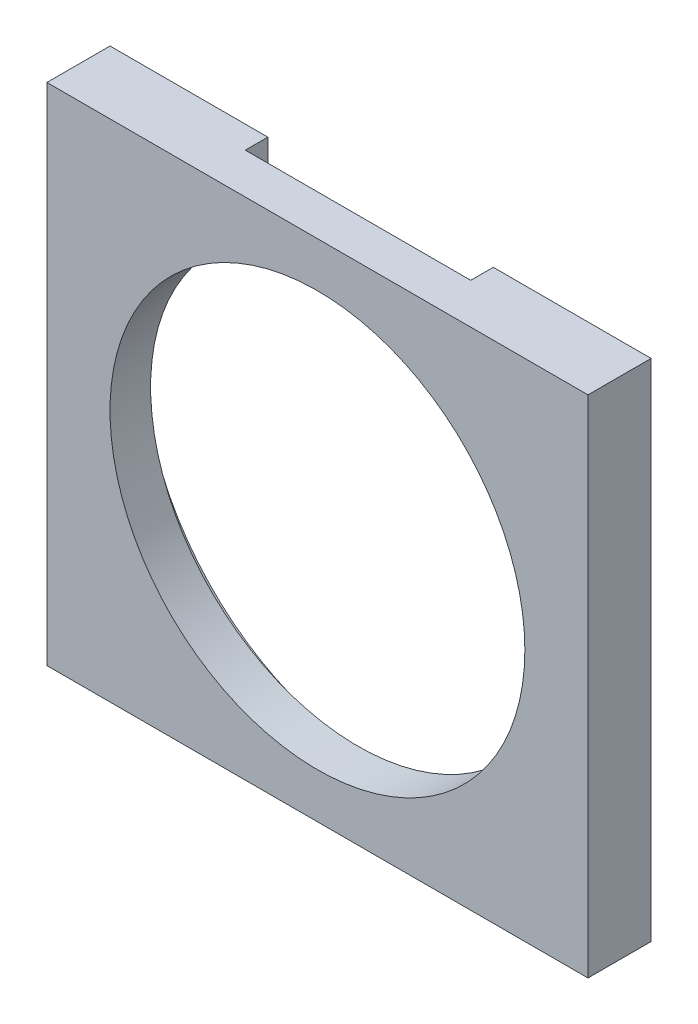
ISO-10303-21;
HEADER;
FILE_DESCRIPTION(('STEP AP214'),'2;1');
FILE_NAME('part.step','',(''),(''),'','','');
FILE_SCHEMA(('AUTOMOTIVE_DESIGN { 1 0 10303 214 1 1 1 1 }'));
ENDSEC;
DATA;
#1=APPLICATION_CONTEXT('core data for automotive mechanical design processes');
#2=APPLICATION_PROTOCOL_DEFINITION('international standard','automotive_design',2000,#1);
#3=PRODUCT_CONTEXT('',#1,'mechanical');
#4=PRODUCT('Part','Part','',(#3));
#5=PRODUCT_RELATED_PRODUCT_CATEGORY('part','',(#4));
#6=PRODUCT_DEFINITION_FORMATION('','',#4);
#7=PRODUCT_DEFINITION_CONTEXT('part definition',#1,'design');
#8=PRODUCT_DEFINITION('design','',#6,#7);
#9=PRODUCT_DEFINITION_SHAPE('','',#8);
#10=(LENGTH_UNIT() NAMED_UNIT(*) SI_UNIT(.MILLI.,.METRE.));
#11=(NAMED_UNIT(*) PLANE_ANGLE_UNIT() SI_UNIT($,.RADIAN.));
#12=(NAMED_UNIT(*) SI_UNIT($,.STERADIAN.) SOLID_ANGLE_UNIT());
#13=UNCERTAINTY_MEASURE_WITH_UNIT(LENGTH_MEASURE(1.E-05),#10,'distance_accuracy_value','');
#14=(GEOMETRIC_REPRESENTATION_CONTEXT(3) GLOBAL_UNCERTAINTY_ASSIGNED_CONTEXT((#13)) GLOBAL_UNIT_ASSIGNED_CONTEXT((#10,
#11,#12)) REPRESENTATION_CONTEXT('',''));
#15=CARTESIAN_POINT('',(0.,0.,0.));
#16=DIRECTION('',(0.,0.,1.));
#17=DIRECTION('',(1.,0.,0.));
#18=AXIS2_PLACEMENT_3D('',#15,#16,#17);
#19=CARTESIAN_POINT('',(0.,0.,6.35));
#20=DIRECTION('',(0.,0.,-1.));
#21=DIRECTION('',(-1.,0.,0.));
#22=AXIS2_PLACEMENT_3D('',#19,#20,#21);
#23=CYLINDRICAL_SURFACE('',#22,66.675);
#24=CARTESIAN_POINT('',(0.,0.,0.));
#25=DIRECTION('',(0.,0.,1.));
#26=DIRECTION('',(1.,0.,0.));
#27=AXIS2_PLACEMENT_3D('',#24,#25,#26);
#28=CIRCLE('',#27,66.675);
#29=CARTESIAN_POINT('',(-31.75,58.6301383675666,0.));
#30=VERTEX_POINT('',#29);
#31=CARTESIAN_POINT('',(31.75,58.6301383675666,0.));
#32=VERTEX_POINT('',#31);
#33=EDGE_CURVE('E138',#30,#32,#28,.T.);
#34=ORIENTED_EDGE('',*,*,#33,.F.);
#35=DIRECTION('',(0.,0.,-1.));
#36=VECTOR('',#35,1.);
#37=CARTESIAN_POINT('',(-31.75,58.6301383675666,6.35));
#38=LINE('',#37,#36);
#39=CARTESIAN_POINT('',(-31.75,58.6301383675666,6.35));
#40=VERTEX_POINT('',#39);
#41=EDGE_CURVE('E11',#40,#30,#38,.T.);
#42=ORIENTED_EDGE('',*,*,#41,.F.);
#43=CARTESIAN_POINT('',(0.,0.,6.35));
#44=DIRECTION('',(0.,0.,1.));
#45=DIRECTION('',(1.,0.,0.));
#46=AXIS2_PLACEMENT_3D('',#43,#44,#45);
#47=CIRCLE('',#46,66.675);
#48=CARTESIAN_POINT('',(31.75,58.6301383675666,6.35));
#49=VERTEX_POINT('',#48);
#50=EDGE_CURVE('E140',#40,#49,#47,.T.);
#51=ORIENTED_EDGE('',*,*,#50,.T.);
#52=DIRECTION('',(0.,0.,-1.));
#53=VECTOR('',#52,1.);
#54=CARTESIAN_POINT('',(31.75,58.6301383675666,6.35));
#55=LINE('',#54,#53);
#56=EDGE_CURVE('E84',#49,#32,#55,.T.);
#57=ORIENTED_EDGE('',*,*,#56,.T.);
#58=EDGE_LOOP('',(#34,#42,#51,#57));
#59=FACE_BOUND('',#58,.T.);
#60=ADVANCED_FACE('F35',(#59),#23,.F.);
#61=CARTESIAN_POINT('',(-31.75,0.,6.35));
#62=DIRECTION('',(1.,0.,0.));
#63=DIRECTION('',(0.,0.,-1.));
#64=AXIS2_PLACEMENT_3D('',#61,#62,#63);
#65=PLANE('',#64);
#66=DIRECTION('',(0.,-1.,0.));
#67=VECTOR('',#66,1.);
#68=CARTESIAN_POINT('',(-31.75,0.,0.));
#69=LINE('',#68,#67);
#70=CARTESIAN_POINT('',(-31.75,71.12,0.));
#71=VERTEX_POINT('',#70);
#72=EDGE_CURVE('E150',#71,#30,#69,.T.);
#73=ORIENTED_EDGE('',*,*,#72,.F.);
#74=DIRECTION('',(0.,0.,-1.));
#75=VECTOR('',#74,1.);
#76=CARTESIAN_POINT('',(-31.75,71.12,6.35));
#77=LINE('',#76,#75);
#78=CARTESIAN_POINT('',(-31.75,71.12,6.35));
#79=VERTEX_POINT('',#78);
#80=EDGE_CURVE('E43',#79,#71,#77,.T.);
#81=ORIENTED_EDGE('',*,*,#80,.F.);
#82=DIRECTION('',(0.,-1.,0.));
#83=VECTOR('',#82,1.);
#84=CARTESIAN_POINT('',(-31.75,0.,6.35));
#85=LINE('',#84,#83);
#86=EDGE_CURVE('E142',#79,#40,#85,.T.);
#87=ORIENTED_EDGE('',*,*,#86,.T.);
#88=ORIENTED_EDGE('',*,*,#41,.T.);
#89=EDGE_LOOP('',(#73,#81,#87,#88));
#90=FACE_BOUND('',#89,.T.);
#91=ADVANCED_FACE('F175',(#90),#65,.T.);
#92=CARTESIAN_POINT('',(-76.2,0.,6.35));
#93=DIRECTION('',(1.,0.,0.));
#94=DIRECTION('',(0.,0.,-1.));
#95=AXIS2_PLACEMENT_3D('',#92,#93,#94);
#96=PLANE('',#95);
#97=DIRECTION('',(0.,-1.,0.));
#98=VECTOR('',#97,1.);
#99=CARTESIAN_POINT('',(-76.2,0.,0.));
#100=LINE('',#99,#98);
#101=CARTESIAN_POINT('',(-76.2,71.12,0.));
#102=VERTEX_POINT('',#101);
#103=CARTESIAN_POINT('',(-76.2,-71.12,0.));
#104=VERTEX_POINT('',#103);
#105=EDGE_CURVE('E109',#102,#104,#100,.T.);
#106=ORIENTED_EDGE('',*,*,#105,.T.);
#107=DIRECTION('',(0.,0.,-1.));
#108=VECTOR('',#107,1.);
#109=CARTESIAN_POINT('',(-76.2,-71.12,6.35));
#110=LINE('',#109,#108);
#111=CARTESIAN_POINT('',(-76.2,-71.12,17.78));
#112=VERTEX_POINT('',#111);
#113=EDGE_CURVE('E103',#112,#104,#110,.T.);
#114=ORIENTED_EDGE('',*,*,#113,.F.);
#115=DIRECTION('',(0.,-1.,0.));
#116=VECTOR('',#115,1.);
#117=CARTESIAN_POINT('',(-76.2,71.12,17.78));
#118=LINE('',#117,#116);
#119=CARTESIAN_POINT('',(-76.2,71.12,17.78));
#120=VERTEX_POINT('',#119);
#121=EDGE_CURVE('E107',#120,#112,#118,.T.);
#122=ORIENTED_EDGE('',*,*,#121,.F.);
#123=DIRECTION('',(0.,0.,-1.));
#124=VECTOR('',#123,1.);
#125=CARTESIAN_POINT('',(-76.2,71.12,6.35));
#126=LINE('',#125,#124);
#127=EDGE_CURVE('E113',#120,#102,#126,.T.);
#128=ORIENTED_EDGE('',*,*,#127,.T.);
#129=EDGE_LOOP('',(#106,#114,#122,#128));
#130=FACE_BOUND('',#129,.T.);
#131=ADVANCED_FACE('F105',(#130),#96,.F.);
#132=CARTESIAN_POINT('',(0.,-71.12,6.35));
#133=DIRECTION('',(0.,1.,0.));
#134=DIRECTION('',(0.,0.,1.));
#135=AXIS2_PLACEMENT_3D('',#132,#133,#134);
#136=PLANE('',#135);
#137=DIRECTION('',(1.,0.,0.));
#138=VECTOR('',#137,1.);
#139=CARTESIAN_POINT('',(0.,-71.12,0.));
#140=LINE('',#139,#138);
#141=CARTESIAN_POINT('',(76.2,-71.12,0.));
#142=VERTEX_POINT('',#141);
#143=EDGE_CURVE('E158',#104,#142,#140,.T.);
#144=ORIENTED_EDGE('',*,*,#143,.T.);
#145=DIRECTION('',(0.,0.,-1.));
#146=VECTOR('',#145,1.);
#147=CARTESIAN_POINT('',(76.2,-71.12,6.35));
#148=LINE('',#147,#146);
#149=CARTESIAN_POINT('',(76.2,-71.12,17.78));
#150=VERTEX_POINT('',#149);
#151=EDGE_CURVE('E114',#150,#142,#148,.T.);
#152=ORIENTED_EDGE('',*,*,#151,.F.);
#153=DIRECTION('',(1.,0.,0.));
#154=VECTOR('',#153,1.);
#155=CARTESIAN_POINT('',(-76.2,-71.12,17.78));
#156=LINE('',#155,#154);
#157=EDGE_CURVE('E117',#112,#150,#156,.T.);
#158=ORIENTED_EDGE('',*,*,#157,.F.);
#159=ORIENTED_EDGE('',*,*,#113,.T.);
#160=EDGE_LOOP('',(#144,#152,#158,#159));
#161=FACE_BOUND('',#160,.T.);
#162=ADVANCED_FACE('F118',(#161),#136,.F.);
#163=CARTESIAN_POINT('',(76.2,0.,6.35));
#164=DIRECTION('',(1.,0.,0.));
#165=DIRECTION('',(0.,0.,-1.));
#166=AXIS2_PLACEMENT_3D('',#163,#164,#165);
#167=PLANE('',#166);
#168=DIRECTION('',(0.,-1.,0.));
#169=VECTOR('',#168,1.);
#170=CARTESIAN_POINT('',(76.2,0.,0.));
#171=LINE('',#170,#169);
#172=CARTESIAN_POINT('',(76.2,71.12,0.));
#173=VERTEX_POINT('',#172);
#174=EDGE_CURVE('E160',#173,#142,#171,.T.);
#175=ORIENTED_EDGE('',*,*,#174,.F.);
#176=DIRECTION('',(0.,0.,-1.));
#177=VECTOR('',#176,1.);
#178=CARTESIAN_POINT('',(76.2,71.12,6.35));
#179=LINE('',#178,#177);
#180=CARTESIAN_POINT('',(76.2,71.12,17.78));
#181=VERTEX_POINT('',#180);
#182=EDGE_CURVE('E166',#181,#173,#179,.T.);
#183=ORIENTED_EDGE('',*,*,#182,.F.);
#184=DIRECTION('',(0.,1.,0.));
#185=VECTOR('',#184,1.);
#186=CARTESIAN_POINT('',(76.2,71.12,17.78));
#187=LINE('',#186,#185);
#188=EDGE_CURVE('E122',#150,#181,#187,.T.);
#189=ORIENTED_EDGE('',*,*,#188,.F.);
#190=ORIENTED_EDGE('',*,*,#151,.T.);
#191=EDGE_LOOP('',(#175,#183,#189,#190));
#192=FACE_BOUND('',#191,.T.);
#193=ADVANCED_FACE('F181',(#192),#167,.T.);
#194=CARTESIAN_POINT('',(0.,71.12,6.35));
#195=DIRECTION('',(0.,1.,0.));
#196=DIRECTION('',(0.,0.,1.));
#197=AXIS2_PLACEMENT_3D('',#194,#195,#196);
#198=PLANE('',#197);
#199=DIRECTION('',(1.,0.,0.));
#200=VECTOR('',#199,1.);
#201=CARTESIAN_POINT('',(0.,71.12,0.));
#202=LINE('',#201,#200);
#203=CARTESIAN_POINT('',(31.75,71.12,0.));
#204=VERTEX_POINT('',#203);
#205=EDGE_CURVE('E156',#204,#173,#202,.T.);
#206=ORIENTED_EDGE('',*,*,#205,.F.);
#207=DIRECTION('',(0.,0.,-1.));
#208=VECTOR('',#207,1.);
#209=CARTESIAN_POINT('',(31.75,71.12,6.35));
#210=LINE('',#209,#208);
#211=CARTESIAN_POINT('',(31.75,71.12,6.35));
#212=VERTEX_POINT('',#211);
#213=EDGE_CURVE('E51',#212,#204,#210,.T.);
#214=ORIENTED_EDGE('',*,*,#213,.F.);
#215=DIRECTION('',(-1.,0.,0.));
#216=VECTOR('',#215,1.);
#217=CARTESIAN_POINT('',(-76.2,71.12,6.35));
#218=LINE('',#217,#216);
#219=EDGE_CURVE('E129',#212,#79,#218,.T.);
#220=ORIENTED_EDGE('',*,*,#219,.T.);
#221=ORIENTED_EDGE('',*,*,#80,.T.);
#222=EDGE_CURVE('E153',#102,#71,#202,.T.);
#223=ORIENTED_EDGE('',*,*,#222,.F.);
#224=ORIENTED_EDGE('',*,*,#127,.F.);
#225=DIRECTION('',(-1.,0.,0.));
#226=VECTOR('',#225,1.);
#227=CARTESIAN_POINT('',(-76.2,71.12,17.78));
#228=LINE('',#227,#226);
#229=EDGE_CURVE('E128',#181,#120,#228,.T.);
#230=ORIENTED_EDGE('',*,*,#229,.F.);
#231=ORIENTED_EDGE('',*,*,#182,.T.);
#232=EDGE_LOOP('',(#206,#214,#220,#221,#223,#224,#230,#231));
#233=FACE_BOUND('',#232,.T.);
#234=ADVANCED_FACE('F171',(#233),#198,.T.);
#235=CARTESIAN_POINT('',(31.7499999999999,0.,6.35));
#236=DIRECTION('',(1.,0.,0.));
#237=DIRECTION('',(0.,1.,0.));
#238=AXIS2_PLACEMENT_3D('',#235,#236,#237);
#239=PLANE('',#238);
#240=DIRECTION('',(0.,-1.,0.));
#241=VECTOR('',#240,1.);
#242=CARTESIAN_POINT('',(31.7499999999999,0.,0.));
#243=LINE('',#242,#241);
#244=EDGE_CURVE('E143',#204,#32,#243,.T.);
#245=ORIENTED_EDGE('',*,*,#244,.T.);
#246=ORIENTED_EDGE('',*,*,#56,.F.);
#247=DIRECTION('',(0.,-1.,0.));
#248=VECTOR('',#247,1.);
#249=CARTESIAN_POINT('',(31.7499999999999,0.,6.35));
#250=LINE('',#249,#248);
#251=EDGE_CURVE('E145',#212,#49,#250,.T.);
#252=ORIENTED_EDGE('',*,*,#251,.F.);
#253=ORIENTED_EDGE('',*,*,#213,.T.);
#254=EDGE_LOOP('',(#245,#246,#252,#253));
#255=FACE_BOUND('',#254,.T.);
#256=ADVANCED_FACE('F188',(#255),#239,.F.);
#257=CARTESIAN_POINT('',(0.,0.,0.));
#258=DIRECTION('',(0.,0.,1.));
#259=DIRECTION('',(1.,0.,0.));
#260=AXIS2_PLACEMENT_3D('',#257,#258,#259);
#261=PLANE('',#260);
#262=ORIENTED_EDGE('',*,*,#33,.T.);
#263=ORIENTED_EDGE('',*,*,#244,.F.);
#264=ORIENTED_EDGE('',*,*,#205,.T.);
#265=ORIENTED_EDGE('',*,*,#174,.T.);
#266=ORIENTED_EDGE('',*,*,#143,.F.);
#267=ORIENTED_EDGE('',*,*,#105,.F.);
#268=ORIENTED_EDGE('',*,*,#222,.T.);
#269=ORIENTED_EDGE('',*,*,#72,.T.);
#270=EDGE_LOOP('',(#262,#263,#264,#265,#266,#267,#268,#269));
#271=FACE_BOUND('',#270,.T.);
#272=ADVANCED_FACE('F177',(#271),#261,.F.);
#273=CARTESIAN_POINT('',(0.,0.,17.78));
#274=DIRECTION('',(0.,0.,1.));
#275=DIRECTION('',(1.,0.,0.));
#276=AXIS2_PLACEMENT_3D('',#273,#274,#275);
#277=PLANE('',#276);
#278=ORIENTED_EDGE('',*,*,#121,.T.);
#279=ORIENTED_EDGE('',*,*,#157,.T.);
#280=ORIENTED_EDGE('',*,*,#188,.T.);
#281=ORIENTED_EDGE('',*,*,#229,.T.);
#282=EDGE_LOOP('',(#278,#279,#280,#281));
#283=FACE_BOUND('',#282,.T.);
#284=CARTESIAN_POINT('',(0.,0.,17.78));
#285=DIRECTION('',(0.,0.,1.));
#286=DIRECTION('',(1.,0.,0.));
#287=AXIS2_PLACEMENT_3D('',#284,#285,#286);
#288=CIRCLE('',#287,58.42);
#289=CARTESIAN_POINT('',(58.42,0.,17.78));
#290=VERTEX_POINT('',#289);
#291=EDGE_CURVE('E131',#290,#290,#288,.T.);
#292=ORIENTED_EDGE('',*,*,#291,.F.);
#293=EDGE_LOOP('',(#292));
#294=FACE_BOUND('',#293,.T.);
#295=ADVANCED_FACE('F125',(#283,#294),#277,.T.);
#296=CARTESIAN_POINT('',(0.,0.,6.35));
#297=DIRECTION('',(0.,0.,1.));
#298=DIRECTION('',(1.,0.,0.));
#299=AXIS2_PLACEMENT_3D('',#296,#297,#298);
#300=PLANE('',#299);
#301=ORIENTED_EDGE('',*,*,#86,.F.);
#302=ORIENTED_EDGE('',*,*,#219,.F.);
#303=ORIENTED_EDGE('',*,*,#251,.T.);
#304=ORIENTED_EDGE('',*,*,#50,.F.);
#305=EDGE_LOOP('',(#301,#302,#303,#304));
#306=FACE_BOUND('',#305,.T.);
#307=CARTESIAN_POINT('',(0.,0.,6.35));
#308=DIRECTION('',(0.,0.,1.));
#309=DIRECTION('',(1.,0.,0.));
#310=AXIS2_PLACEMENT_3D('',#307,#308,#309);
#311=CIRCLE('',#310,58.42);
#312=CARTESIAN_POINT('',(58.42,0.,6.35));
#313=VERTEX_POINT('',#312);
#314=EDGE_CURVE('E134',#313,#313,#311,.T.);
#315=ORIENTED_EDGE('',*,*,#314,.T.);
#316=EDGE_LOOP('',(#315));
#317=FACE_BOUND('',#316,.T.);
#318=ADVANCED_FACE('F197',(#306,#317),#300,.F.);
#319=CARTESIAN_POINT('',(0.,0.,17.78));
#320=DIRECTION('',(0.,0.,-1.));
#321=DIRECTION('',(-1.,0.,0.));
#322=AXIS2_PLACEMENT_3D('',#319,#320,#321);
#323=CYLINDRICAL_SURFACE('',#322,58.42);
#324=ORIENTED_EDGE('',*,*,#291,.T.);
#325=EDGE_LOOP('',(#324));
#326=FACE_BOUND('',#325,.T.);
#327=ORIENTED_EDGE('',*,*,#314,.F.);
#328=EDGE_LOOP('',(#327));
#329=FACE_BOUND('',#328,.T.);
#330=ADVANCED_FACE('F200',(#326,#329),#323,.F.);
#331=CLOSED_SHELL('',(#60,#91,#131,#162,#193,#234,#256,#272,#295,#318,#330));
#332=MANIFOLD_SOLID_BREP('B2',#331);
#333=ADVANCED_BREP_SHAPE_REPRESENTATION('',(#18,#332),#14);
#334=SHAPE_DEFINITION_REPRESENTATION(#9,#333);
ENDSEC;
END-ISO-10303-21;
